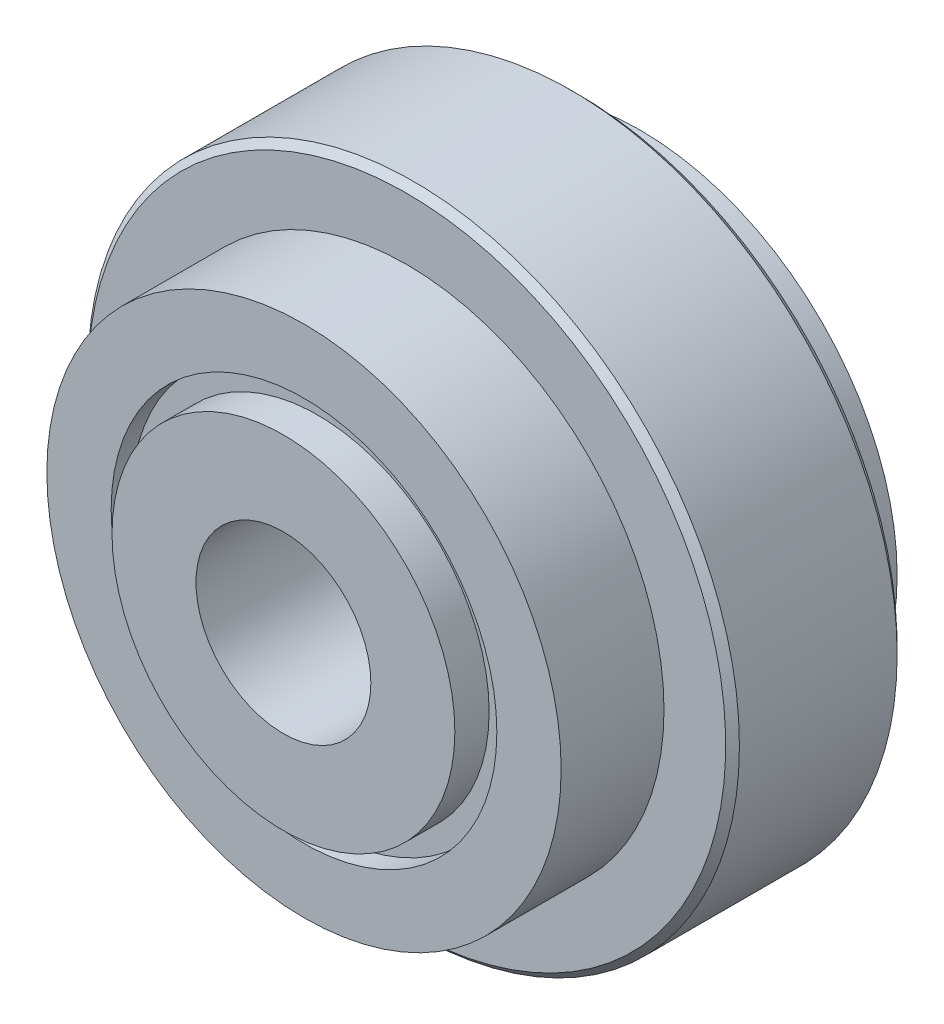
ISO-10303-21;
HEADER;
FILE_DESCRIPTION(('STEP AP214'),'2;1');
FILE_NAME('part.step','',(''),(''),'','','');
FILE_SCHEMA(('AUTOMOTIVE_DESIGN { 1 0 10303 214 1 1 1 1 }'));
ENDSEC;
DATA;
#1=APPLICATION_CONTEXT('core data for automotive mechanical design processes');
#2=APPLICATION_PROTOCOL_DEFINITION('international standard','automotive_design',2000,#1);
#3=PRODUCT_CONTEXT('',#1,'mechanical');
#4=PRODUCT('Part','Part','',(#3));
#5=PRODUCT_RELATED_PRODUCT_CATEGORY('part','',(#4));
#6=PRODUCT_DEFINITION_FORMATION('','',#4);
#7=PRODUCT_DEFINITION_CONTEXT('part definition',#1,'design');
#8=PRODUCT_DEFINITION('design','',#6,#7);
#9=PRODUCT_DEFINITION_SHAPE('','',#8);
#10=(LENGTH_UNIT() NAMED_UNIT(*) SI_UNIT(.MILLI.,.METRE.));
#11=(NAMED_UNIT(*) PLANE_ANGLE_UNIT() SI_UNIT($,.RADIAN.));
#12=(NAMED_UNIT(*) SI_UNIT($,.STERADIAN.) SOLID_ANGLE_UNIT());
#13=UNCERTAINTY_MEASURE_WITH_UNIT(LENGTH_MEASURE(1.E-05),#10,'distance_accuracy_value','');
#14=(GEOMETRIC_REPRESENTATION_CONTEXT(3) GLOBAL_UNCERTAINTY_ASSIGNED_CONTEXT((#13)) GLOBAL_UNIT_ASSIGNED_CONTEXT((#10,
#11,#12)) REPRESENTATION_CONTEXT('',''));
#15=CARTESIAN_POINT('',(0.,0.,0.));
#16=DIRECTION('',(0.,0.,1.));
#17=DIRECTION('',(1.,0.,0.));
#18=AXIS2_PLACEMENT_3D('',#15,#16,#17);
#19=CARTESIAN_POINT('',(0.,-5.,-4.5));
#20=DIRECTION('',(0.,0.,-1.));
#21=DIRECTION('',(-1.,0.,0.));
#22=AXIS2_PLACEMENT_3D('',#19,#20,#21);
#23=PLANE('',#22);
#24=CARTESIAN_POINT('',(0.,0.,-4.5));
#25=DIRECTION('',(0.,0.,1.));
#26=DIRECTION('',(1.,0.,0.));
#27=AXIS2_PLACEMENT_3D('',#24,#25,#26);
#28=CIRCLE('',#27,2.75);
#29=CARTESIAN_POINT('',(2.75,0.,-4.5));
#30=VERTEX_POINT('',#29);
#31=EDGE_CURVE('E11',#30,#30,#28,.T.);
#32=ORIENTED_EDGE('',*,*,#31,.F.);
#33=EDGE_LOOP('',(#32));
#34=FACE_BOUND('',#33,.T.);
#35=CARTESIAN_POINT('',(0.,0.,-4.5));
#36=DIRECTION('',(0.,0.,1.));
#37=DIRECTION('',(1.,0.,0.));
#38=AXIS2_PLACEMENT_3D('',#35,#36,#37);
#39=CIRCLE('',#38,5.);
#40=CARTESIAN_POINT('',(5.,0.,-4.5));
#41=VERTEX_POINT('',#40);
#42=EDGE_CURVE('E57',#41,#41,#39,.T.);
#43=ORIENTED_EDGE('',*,*,#42,.T.);
#44=EDGE_LOOP('',(#43));
#45=FACE_BOUND('',#44,.T.);
#46=ADVANCED_FACE('F43',(#34,#45),#23,.F.);
#47=CARTESIAN_POINT('',(0.,0.,4.9));
#48=DIRECTION('',(0.,0.,1.));
#49=DIRECTION('',(1.,0.,0.));
#50=AXIS2_PLACEMENT_3D('',#47,#48,#49);
#51=CYLINDRICAL_SURFACE('',#50,2.75);
#52=CARTESIAN_POINT('',(0.,0.,-5.5));
#53=DIRECTION('',(0.,0.,1.));
#54=DIRECTION('',(1.,0.,0.));
#55=AXIS2_PLACEMENT_3D('',#52,#53,#54);
#56=CIRCLE('',#55,2.75);
#57=CARTESIAN_POINT('',(2.75,0.,-5.5));
#58=VERTEX_POINT('',#57);
#59=EDGE_CURVE('E49',#58,#58,#56,.T.);
#60=ORIENTED_EDGE('',*,*,#59,.F.);
#61=EDGE_LOOP('',(#60));
#62=FACE_BOUND('',#61,.T.);
#63=ORIENTED_EDGE('',*,*,#31,.T.);
#64=EDGE_LOOP('',(#63));
#65=FACE_BOUND('',#64,.T.);
#66=ADVANCED_FACE('F72',(#62,#65),#51,.F.);
#67=CARTESIAN_POINT('',(0.,-5.,-5.5));
#68=DIRECTION('',(0.,0.,1.));
#69=DIRECTION('',(1.,0.,0.));
#70=AXIS2_PLACEMENT_3D('',#67,#68,#69);
#71=PLANE('',#70);
#72=CARTESIAN_POINT('',(0.,0.,-5.5));
#73=DIRECTION('',(0.,0.,1.));
#74=DIRECTION('',(1.,0.,0.));
#75=AXIS2_PLACEMENT_3D('',#72,#73,#74);
#76=CIRCLE('',#75,5.);
#77=CARTESIAN_POINT('',(5.,0.,-5.5));
#78=VERTEX_POINT('',#77);
#79=EDGE_CURVE('E53',#78,#78,#76,.T.);
#80=ORIENTED_EDGE('',*,*,#79,.F.);
#81=EDGE_LOOP('',(#80));
#82=FACE_BOUND('',#81,.T.);
#83=ORIENTED_EDGE('',*,*,#59,.T.);
#84=EDGE_LOOP('',(#83));
#85=FACE_BOUND('',#84,.T.);
#86=ADVANCED_FACE('F67',(#82,#85),#71,.F.);
#87=CARTESIAN_POINT('',(0.,0.,4.9));
#88=DIRECTION('',(0.,0.,1.));
#89=DIRECTION('',(1.,0.,0.));
#90=AXIS2_PLACEMENT_3D('',#87,#88,#89);
#91=CYLINDRICAL_SURFACE('',#90,5.);
#92=ORIENTED_EDGE('',*,*,#42,.F.);
#93=EDGE_LOOP('',(#92));
#94=FACE_BOUND('',#93,.T.);
#95=ORIENTED_EDGE('',*,*,#79,.T.);
#96=EDGE_LOOP('',(#95));
#97=FACE_BOUND('',#96,.T.);
#98=ADVANCED_FACE('F64',(#94,#97),#91,.T.);
#99=CLOSED_SHELL('',(#46,#66,#86,#98));
#100=MANIFOLD_SOLID_BREP('B2',#99);
#101=CARTESIAN_POINT('',(0.,5.,5.5));
#102=DIRECTION('',(0.,0.,-1.));
#103=DIRECTION('',(-1.,0.,0.));
#104=AXIS2_PLACEMENT_3D('',#101,#102,#103);
#105=PLANE('',#104);
#106=CARTESIAN_POINT('',(0.,0.,5.5));
#107=DIRECTION('',(0.,0.,1.));
#108=DIRECTION('',(1.,0.,0.));
#109=AXIS2_PLACEMENT_3D('',#106,#107,#108);
#110=CIRCLE('',#109,2.55);
#111=CARTESIAN_POINT('',(2.55,0.,5.5));
#112=VERTEX_POINT('',#111);
#113=EDGE_CURVE('E42',#112,#112,#110,.T.);
#114=ORIENTED_EDGE('',*,*,#113,.F.);
#115=EDGE_LOOP('',(#114));
#116=FACE_BOUND('',#115,.T.);
#117=CARTESIAN_POINT('',(0.,0.,5.5));
#118=DIRECTION('',(0.,0.,1.));
#119=DIRECTION('',(1.,0.,0.));
#120=AXIS2_PLACEMENT_3D('',#117,#118,#119);
#121=CIRCLE('',#120,5.);
#122=CARTESIAN_POINT('',(5.,0.,5.5));
#123=VERTEX_POINT('',#122);
#124=EDGE_CURVE('E133',#123,#123,#121,.T.);
#125=ORIENTED_EDGE('',*,*,#124,.T.);
#126=EDGE_LOOP('',(#125));
#127=FACE_BOUND('',#126,.T.);
#128=ADVANCED_FACE('F111',(#116,#127),#105,.F.);
#129=CARTESIAN_POINT('',(0.,0.,4.9));
#130=DIRECTION('',(0.,0.,1.));
#131=DIRECTION('',(1.,0.,0.));
#132=AXIS2_PLACEMENT_3D('',#129,#130,#131);
#133=CYLINDRICAL_SURFACE('',#132,2.55);
#134=CARTESIAN_POINT('',(0.,0.,-4.5));
#135=DIRECTION('',(0.,0.,1.));
#136=DIRECTION('',(1.,0.,0.));
#137=AXIS2_PLACEMENT_3D('',#134,#135,#136);
#138=CIRCLE('',#137,2.55);
#139=CARTESIAN_POINT('',(2.55,0.,-4.5));
#140=VERTEX_POINT('',#139);
#141=EDGE_CURVE('E117',#140,#140,#138,.T.);
#142=ORIENTED_EDGE('',*,*,#141,.F.);
#143=EDGE_LOOP('',(#142));
#144=FACE_BOUND('',#143,.T.);
#145=ORIENTED_EDGE('',*,*,#113,.T.);
#146=EDGE_LOOP('',(#145));
#147=FACE_BOUND('',#146,.T.);
#148=ADVANCED_FACE('F158',(#144,#147),#133,.F.);
#149=CARTESIAN_POINT('',(0.,3.5,-4.5));
#150=DIRECTION('',(0.,0.,1.));
#151=DIRECTION('',(1.,0.,0.));
#152=AXIS2_PLACEMENT_3D('',#149,#150,#151);
#153=PLANE('',#152);
#154=CARTESIAN_POINT('',(0.,0.,-4.5));
#155=DIRECTION('',(0.,0.,1.));
#156=DIRECTION('',(1.,0.,0.));
#157=AXIS2_PLACEMENT_3D('',#154,#155,#156);
#158=CIRCLE('',#157,3.5);
#159=CARTESIAN_POINT('',(3.5,0.,-4.5));
#160=VERTEX_POINT('',#159);
#161=EDGE_CURVE('E121',#160,#160,#158,.T.);
#162=ORIENTED_EDGE('',*,*,#161,.F.);
#163=EDGE_LOOP('',(#162));
#164=FACE_BOUND('',#163,.T.);
#165=ORIENTED_EDGE('',*,*,#141,.T.);
#166=EDGE_LOOP('',(#165));
#167=FACE_BOUND('',#166,.T.);
#168=ADVANCED_FACE('F153',(#164,#167),#153,.F.);
#169=CARTESIAN_POINT('',(0.,0.,4.9));
#170=DIRECTION('',(0.,0.,1.));
#171=DIRECTION('',(1.,0.,0.));
#172=AXIS2_PLACEMENT_3D('',#169,#170,#171);
#173=CYLINDRICAL_SURFACE('',#172,3.5);
#174=CARTESIAN_POINT('',(0.,0.,4.5));
#175=DIRECTION('',(0.,0.,1.));
#176=DIRECTION('',(1.,0.,0.));
#177=AXIS2_PLACEMENT_3D('',#174,#175,#176);
#178=CIRCLE('',#177,3.5);
#179=CARTESIAN_POINT('',(3.5,0.,4.5));
#180=VERTEX_POINT('',#179);
#181=EDGE_CURVE('E125',#180,#180,#178,.T.);
#182=ORIENTED_EDGE('',*,*,#181,.F.);
#183=EDGE_LOOP('',(#182));
#184=FACE_BOUND('',#183,.T.);
#185=ORIENTED_EDGE('',*,*,#161,.T.);
#186=EDGE_LOOP('',(#185));
#187=FACE_BOUND('',#186,.T.);
#188=ADVANCED_FACE('F147',(#184,#187),#173,.T.);
#189=CARTESIAN_POINT('',(0.,5.,4.5));
#190=DIRECTION('',(0.,0.,1.));
#191=DIRECTION('',(1.,0.,0.));
#192=AXIS2_PLACEMENT_3D('',#189,#190,#191);
#193=PLANE('',#192);
#194=CARTESIAN_POINT('',(0.,0.,4.5));
#195=DIRECTION('',(0.,0.,1.));
#196=DIRECTION('',(1.,0.,0.));
#197=AXIS2_PLACEMENT_3D('',#194,#195,#196);
#198=CIRCLE('',#197,5.);
#199=CARTESIAN_POINT('',(5.,0.,4.5));
#200=VERTEX_POINT('',#199);
#201=EDGE_CURVE('E130',#200,#200,#198,.T.);
#202=ORIENTED_EDGE('',*,*,#201,.F.);
#203=EDGE_LOOP('',(#202));
#204=FACE_BOUND('',#203,.T.);
#205=ORIENTED_EDGE('',*,*,#181,.T.);
#206=EDGE_LOOP('',(#205));
#207=FACE_BOUND('',#206,.T.);
#208=ADVANCED_FACE('F141',(#204,#207),#193,.F.);
#209=CARTESIAN_POINT('',(0.,0.,4.9));
#210=DIRECTION('',(0.,0.,1.));
#211=DIRECTION('',(1.,0.,0.));
#212=AXIS2_PLACEMENT_3D('',#209,#210,#211);
#213=CYLINDRICAL_SURFACE('',#212,5.);
#214=ORIENTED_EDGE('',*,*,#124,.F.);
#215=EDGE_LOOP('',(#214));
#216=FACE_BOUND('',#215,.T.);
#217=ORIENTED_EDGE('',*,*,#201,.T.);
#218=EDGE_LOOP('',(#217));
#219=FACE_BOUND('',#218,.T.);
#220=ADVANCED_FACE('F138',(#216,#219),#213,.T.);
#221=CLOSED_SHELL('',(#128,#148,#168,#188,#208,#220));
#222=MANIFOLD_SOLID_BREP('B6',#221);
#223=CARTESIAN_POINT('',(0.,0.,-4.9));
#224=DIRECTION('',(0.,0.,-1.));
#225=DIRECTION('',(-1.,0.,0.));
#226=AXIS2_PLACEMENT_3D('',#223,#224,#225);
#227=CYLINDRICAL_SURFACE('',#226,9.5);
#228=CARTESIAN_POINT('',(0.,0.,1.7));
#229=DIRECTION('',(0.,0.,-1.));
#230=DIRECTION('',(-1.,0.,0.));
#231=AXIS2_PLACEMENT_3D('',#228,#229,#230);
#232=CIRCLE('',#231,9.5);
#233=CARTESIAN_POINT('',(-9.5,0.,1.7));
#234=VERTEX_POINT('',#233);
#235=EDGE_CURVE('E254',#234,#234,#232,.T.);
#236=ORIENTED_EDGE('',*,*,#235,.T.);
#237=EDGE_LOOP('',(#236));
#238=FACE_BOUND('',#237,.T.);
#239=CARTESIAN_POINT('',(0.,0.,-2.9));
#240=DIRECTION('',(0.,0.,-1.));
#241=DIRECTION('',(-1.,0.,0.));
#242=AXIS2_PLACEMENT_3D('',#239,#240,#241);
#243=CIRCLE('',#242,9.5);
#244=CARTESIAN_POINT('',(-9.5,0.,-2.9));
#245=VERTEX_POINT('',#244);
#246=EDGE_CURVE('E110',#245,#245,#243,.T.);
#247=ORIENTED_EDGE('',*,*,#246,.F.);
#248=EDGE_LOOP('',(#247));
#249=FACE_BOUND('',#248,.T.);
#250=ADVANCED_FACE('F202',(#238,#249),#227,.T.);
#251=CARTESIAN_POINT('',(0.,0.,-3.1));
#252=DIRECTION('',(0.,0.,1.));
#253=DIRECTION('',(1.,0.,0.));
#254=AXIS2_PLACEMENT_3D('',#251,#252,#253);
#255=CONICAL_SURFACE('',#254,9.3,0.785398163397441);
#256=ORIENTED_EDGE('',*,*,#246,.T.);
#257=EDGE_LOOP('',(#256));
#258=FACE_BOUND('',#257,.T.);
#259=CARTESIAN_POINT('',(0.,0.,-3.1));
#260=DIRECTION('',(0.,0.,-1.));
#261=DIRECTION('',(-1.,0.,0.));
#262=AXIS2_PLACEMENT_3D('',#259,#260,#261);
#263=CIRCLE('',#262,9.3);
#264=CARTESIAN_POINT('',(-9.3,0.,-3.1));
#265=VERTEX_POINT('',#264);
#266=EDGE_CURVE('E208',#265,#265,#263,.T.);
#267=ORIENTED_EDGE('',*,*,#266,.F.);
#268=EDGE_LOOP('',(#267));
#269=FACE_BOUND('',#268,.T.);
#270=ADVANCED_FACE('F272',(#258,#269),#255,.T.);
#271=CARTESIAN_POINT('',(0.,-9.3,-3.1));
#272=DIRECTION('',(0.,0.,-1.));
#273=DIRECTION('',(-1.,0.,0.));
#274=AXIS2_PLACEMENT_3D('',#271,#272,#273);
#275=PLANE('',#274);
#276=ORIENTED_EDGE('',*,*,#266,.T.);
#277=EDGE_LOOP('',(#276));
#278=FACE_BOUND('',#277,.T.);
#279=CARTESIAN_POINT('',(0.,0.,-3.1));
#280=DIRECTION('',(0.,0.,-1.));
#281=DIRECTION('',(-1.,0.,0.));
#282=AXIS2_PLACEMENT_3D('',#279,#280,#281);
#283=CIRCLE('',#282,7.5);
#284=CARTESIAN_POINT('',(-7.5,0.,-3.1));
#285=VERTEX_POINT('',#284);
#286=EDGE_CURVE('E212',#285,#285,#283,.T.);
#287=ORIENTED_EDGE('',*,*,#286,.F.);
#288=EDGE_LOOP('',(#287));
#289=FACE_BOUND('',#288,.T.);
#290=ADVANCED_FACE('F276',(#278,#289),#275,.T.);
#291=CARTESIAN_POINT('',(0.,0.,-4.9));
#292=DIRECTION('',(0.,0.,-1.));
#293=DIRECTION('',(-1.,0.,0.));
#294=AXIS2_PLACEMENT_3D('',#291,#292,#293);
#295=CYLINDRICAL_SURFACE('',#294,7.5);
#296=ORIENTED_EDGE('',*,*,#286,.T.);
#297=EDGE_LOOP('',(#296));
#298=FACE_BOUND('',#297,.T.);
#299=CARTESIAN_POINT('',(0.,0.,-4.9));
#300=DIRECTION('',(0.,0.,-1.));
#301=DIRECTION('',(-1.,0.,0.));
#302=AXIS2_PLACEMENT_3D('',#299,#300,#301);
#303=CIRCLE('',#302,7.5);
#304=CARTESIAN_POINT('',(-7.5,0.,-4.9));
#305=VERTEX_POINT('',#304);
#306=EDGE_CURVE('E216',#305,#305,#303,.T.);
#307=ORIENTED_EDGE('',*,*,#306,.F.);
#308=EDGE_LOOP('',(#307));
#309=FACE_BOUND('',#308,.T.);
#310=ADVANCED_FACE('F280',(#298,#309),#295,.T.);
#311=CARTESIAN_POINT('',(0.,-5.625,-4.9));
#312=DIRECTION('',(0.,0.,-1.));
#313=DIRECTION('',(-1.,0.,0.));
#314=AXIS2_PLACEMENT_3D('',#311,#312,#313);
#315=PLANE('',#314);
#316=ORIENTED_EDGE('',*,*,#306,.T.);
#317=EDGE_LOOP('',(#316));
#318=FACE_BOUND('',#317,.T.);
#319=CARTESIAN_POINT('',(0.,0.,-4.9));
#320=DIRECTION('',(0.,0.,-1.));
#321=DIRECTION('',(-1.,0.,0.));
#322=AXIS2_PLACEMENT_3D('',#319,#320,#321);
#323=CIRCLE('',#322,5.625);
#324=CARTESIAN_POINT('',(-5.625,0.,-4.9));
#325=VERTEX_POINT('',#324);
#326=EDGE_CURVE('E221',#325,#325,#323,.T.);
#327=ORIENTED_EDGE('',*,*,#326,.F.);
#328=EDGE_LOOP('',(#327));
#329=FACE_BOUND('',#328,.T.);
#330=ADVANCED_FACE('F286',(#318,#329),#315,.T.);
#331=CARTESIAN_POINT('',(0.,0.,-4.9));
#332=DIRECTION('',(0.,0.,-1.));
#333=DIRECTION('',(-1.,0.,0.));
#334=AXIS2_PLACEMENT_3D('',#331,#332,#333);
#335=CYLINDRICAL_SURFACE('',#334,5.625);
#336=ORIENTED_EDGE('',*,*,#326,.T.);
#337=EDGE_LOOP('',(#336));
#338=FACE_BOUND('',#337,.T.);
#339=CARTESIAN_POINT('',(0.,0.,-4.3));
#340=DIRECTION('',(0.,0.,-1.));
#341=DIRECTION('',(-1.,0.,0.));
#342=AXIS2_PLACEMENT_3D('',#339,#340,#341);
#343=CIRCLE('',#342,5.625);
#344=CARTESIAN_POINT('',(-5.625,0.,-4.3));
#345=VERTEX_POINT('',#344);
#346=EDGE_CURVE('E224',#345,#345,#343,.T.);
#347=ORIENTED_EDGE('',*,*,#346,.F.);
#348=EDGE_LOOP('',(#347));
#349=FACE_BOUND('',#348,.T.);
#350=ADVANCED_FACE('F290',(#338,#349),#335,.F.);
#351=CARTESIAN_POINT('',(0.,-4.05,-4.3));
#352=DIRECTION('',(0.,0.,-1.));
#353=DIRECTION('',(-1.,0.,0.));
#354=AXIS2_PLACEMENT_3D('',#351,#352,#353);
#355=PLANE('',#354);
#356=ORIENTED_EDGE('',*,*,#346,.T.);
#357=EDGE_LOOP('',(#356));
#358=FACE_BOUND('',#357,.T.);
#359=CARTESIAN_POINT('',(0.,0.,-4.3));
#360=DIRECTION('',(0.,0.,-1.));
#361=DIRECTION('',(-1.,0.,0.));
#362=AXIS2_PLACEMENT_3D('',#359,#360,#361);
#363=CIRCLE('',#362,4.05);
#364=CARTESIAN_POINT('',(-4.05,0.,-4.3));
#365=VERTEX_POINT('',#364);
#366=EDGE_CURVE('E227',#365,#365,#363,.T.);
#367=ORIENTED_EDGE('',*,*,#366,.F.);
#368=EDGE_LOOP('',(#367));
#369=FACE_BOUND('',#368,.T.);
#370=ADVANCED_FACE('F294',(#358,#369),#355,.T.);
#371=CARTESIAN_POINT('',(0.,0.,-3.8));
#372=DIRECTION('',(0.,0.,-1.));
#373=DIRECTION('',(-1.,0.,0.));
#374=AXIS2_PLACEMENT_3D('',#371,#372,#373);
#375=TOROIDAL_SURFACE('',#374,4.05,0.5);
#376=ORIENTED_EDGE('',*,*,#366,.T.);
#377=EDGE_LOOP('',(#376));
#378=FACE_BOUND('',#377,.T.);
#379=CARTESIAN_POINT('',(0.,0.,-3.8));
#380=DIRECTION('',(0.,0.,-1.));
#381=DIRECTION('',(-1.,0.,0.));
#382=AXIS2_PLACEMENT_3D('',#379,#380,#381);
#383=CIRCLE('',#382,3.55);
#384=CARTESIAN_POINT('',(-3.55,0.,-3.8));
#385=VERTEX_POINT('',#384);
#386=EDGE_CURVE('E230',#385,#385,#383,.T.);
#387=ORIENTED_EDGE('',*,*,#386,.F.);
#388=EDGE_LOOP('',(#387));
#389=FACE_BOUND('',#388,.T.);
#390=ADVANCED_FACE('F298',(#378,#389),#375,.T.);
#391=CARTESIAN_POINT('',(0.,0.,-4.9));
#392=DIRECTION('',(0.,0.,-1.));
#393=DIRECTION('',(-1.,0.,0.));
#394=AXIS2_PLACEMENT_3D('',#391,#392,#393);
#395=CYLINDRICAL_SURFACE('',#394,3.55);
#396=ORIENTED_EDGE('',*,*,#386,.T.);
#397=EDGE_LOOP('',(#396));
#398=FACE_BOUND('',#397,.T.);
#399=CARTESIAN_POINT('',(0.,0.,3.8));
#400=DIRECTION('',(0.,0.,-1.));
#401=DIRECTION('',(-1.,0.,0.));
#402=AXIS2_PLACEMENT_3D('',#399,#400,#401);
#403=CIRCLE('',#402,3.55);
#404=CARTESIAN_POINT('',(-3.55,0.,3.8));
#405=VERTEX_POINT('',#404);
#406=EDGE_CURVE('E233',#405,#405,#403,.T.);
#407=ORIENTED_EDGE('',*,*,#406,.F.);
#408=EDGE_LOOP('',(#407));
#409=FACE_BOUND('',#408,.T.);
#410=ADVANCED_FACE('F302',(#398,#409),#395,.F.);
#411=CARTESIAN_POINT('',(0.,0.,3.8));
#412=DIRECTION('',(0.,0.,-1.));
#413=DIRECTION('',(-1.,0.,0.));
#414=AXIS2_PLACEMENT_3D('',#411,#412,#413);
#415=TOROIDAL_SURFACE('',#414,4.05,0.5);
#416=ORIENTED_EDGE('',*,*,#406,.T.);
#417=EDGE_LOOP('',(#416));
#418=FACE_BOUND('',#417,.T.);
#419=CARTESIAN_POINT('',(0.,0.,4.3));
#420=DIRECTION('',(0.,0.,-1.));
#421=DIRECTION('',(-1.,0.,0.));
#422=AXIS2_PLACEMENT_3D('',#419,#420,#421);
#423=CIRCLE('',#422,4.05);
#424=CARTESIAN_POINT('',(-4.05,0.,4.3));
#425=VERTEX_POINT('',#424);
#426=EDGE_CURVE('E236',#425,#425,#423,.T.);
#427=ORIENTED_EDGE('',*,*,#426,.F.);
#428=EDGE_LOOP('',(#427));
#429=FACE_BOUND('',#428,.T.);
#430=ADVANCED_FACE('F306',(#418,#429),#415,.T.);
#431=CARTESIAN_POINT('',(0.,-5.625,4.3));
#432=DIRECTION('',(0.,0.,1.));
#433=DIRECTION('',(1.,0.,0.));
#434=AXIS2_PLACEMENT_3D('',#431,#432,#433);
#435=PLANE('',#434);
#436=ORIENTED_EDGE('',*,*,#426,.T.);
#437=EDGE_LOOP('',(#436));
#438=FACE_BOUND('',#437,.T.);
#439=CARTESIAN_POINT('',(0.,0.,4.3));
#440=DIRECTION('',(0.,0.,-1.));
#441=DIRECTION('',(-1.,0.,0.));
#442=AXIS2_PLACEMENT_3D('',#439,#440,#441);
#443=CIRCLE('',#442,5.625);
#444=CARTESIAN_POINT('',(-5.625,0.,4.3));
#445=VERTEX_POINT('',#444);
#446=EDGE_CURVE('E239',#445,#445,#443,.T.);
#447=ORIENTED_EDGE('',*,*,#446,.F.);
#448=EDGE_LOOP('',(#447));
#449=FACE_BOUND('',#448,.T.);
#450=ADVANCED_FACE('F310',(#438,#449),#435,.T.);
#451=CARTESIAN_POINT('',(0.,0.,-4.9));
#452=DIRECTION('',(0.,0.,-1.));
#453=DIRECTION('',(-1.,0.,0.));
#454=AXIS2_PLACEMENT_3D('',#451,#452,#453);
#455=CYLINDRICAL_SURFACE('',#454,5.625);
#456=ORIENTED_EDGE('',*,*,#446,.T.);
#457=EDGE_LOOP('',(#456));
#458=FACE_BOUND('',#457,.T.);
#459=CARTESIAN_POINT('',(0.,0.,4.9));
#460=DIRECTION('',(0.,0.,-1.));
#461=DIRECTION('',(-1.,0.,0.));
#462=AXIS2_PLACEMENT_3D('',#459,#460,#461);
#463=CIRCLE('',#462,5.625);
#464=CARTESIAN_POINT('',(-5.625,0.,4.9));
#465=VERTEX_POINT('',#464);
#466=EDGE_CURVE('E242',#465,#465,#463,.T.);
#467=ORIENTED_EDGE('',*,*,#466,.F.);
#468=EDGE_LOOP('',(#467));
#469=FACE_BOUND('',#468,.T.);
#470=ADVANCED_FACE('F314',(#458,#469),#455,.F.);
#471=CARTESIAN_POINT('',(0.,-5.625,4.9));
#472=DIRECTION('',(0.,0.,1.));
#473=DIRECTION('',(1.,0.,0.));
#474=AXIS2_PLACEMENT_3D('',#471,#472,#473);
#475=PLANE('',#474);
#476=ORIENTED_EDGE('',*,*,#466,.T.);
#477=EDGE_LOOP('',(#476));
#478=FACE_BOUND('',#477,.T.);
#479=CARTESIAN_POINT('',(0.,0.,4.9));
#480=DIRECTION('',(0.,0.,-1.));
#481=DIRECTION('',(-1.,0.,0.));
#482=AXIS2_PLACEMENT_3D('',#479,#480,#481);
#483=CIRCLE('',#482,7.5);
#484=CARTESIAN_POINT('',(-7.5,0.,4.9));
#485=VERTEX_POINT('',#484);
#486=EDGE_CURVE('E245',#485,#485,#483,.T.);
#487=ORIENTED_EDGE('',*,*,#486,.F.);
#488=EDGE_LOOP('',(#487));
#489=FACE_BOUND('',#488,.T.);
#490=ADVANCED_FACE('F318',(#478,#489),#475,.T.);
#491=CARTESIAN_POINT('',(0.,0.,-4.9));
#492=DIRECTION('',(0.,0.,-1.));
#493=DIRECTION('',(-1.,0.,0.));
#494=AXIS2_PLACEMENT_3D('',#491,#492,#493);
#495=CYLINDRICAL_SURFACE('',#494,7.5);
#496=ORIENTED_EDGE('',*,*,#486,.T.);
#497=EDGE_LOOP('',(#496));
#498=FACE_BOUND('',#497,.T.);
#499=CARTESIAN_POINT('',(0.,0.,1.9));
#500=DIRECTION('',(0.,0.,-1.));
#501=DIRECTION('',(-1.,0.,0.));
#502=AXIS2_PLACEMENT_3D('',#499,#500,#501);
#503=CIRCLE('',#502,7.5);
#504=CARTESIAN_POINT('',(-7.5,0.,1.9));
#505=VERTEX_POINT('',#504);
#506=EDGE_CURVE('E248',#505,#505,#503,.T.);
#507=ORIENTED_EDGE('',*,*,#506,.F.);
#508=EDGE_LOOP('',(#507));
#509=FACE_BOUND('',#508,.T.);
#510=ADVANCED_FACE('F268',(#498,#509),#495,.T.);
#511=CARTESIAN_POINT('',(0.,-7.5,1.9));
#512=DIRECTION('',(0.,0.,1.));
#513=DIRECTION('',(1.,0.,0.));
#514=AXIS2_PLACEMENT_3D('',#511,#512,#513);
#515=PLANE('',#514);
#516=ORIENTED_EDGE('',*,*,#506,.T.);
#517=EDGE_LOOP('',(#516));
#518=FACE_BOUND('',#517,.T.);
#519=CARTESIAN_POINT('',(0.,0.,1.9));
#520=DIRECTION('',(0.,0.,-1.));
#521=DIRECTION('',(-1.,0.,0.));
#522=AXIS2_PLACEMENT_3D('',#519,#520,#521);
#523=CIRCLE('',#522,9.3);
#524=CARTESIAN_POINT('',(-9.3,0.,1.9));
#525=VERTEX_POINT('',#524);
#526=EDGE_CURVE('E251',#525,#525,#523,.T.);
#527=ORIENTED_EDGE('',*,*,#526,.F.);
#528=EDGE_LOOP('',(#527));
#529=FACE_BOUND('',#528,.T.);
#530=ADVANCED_FACE('F262',(#518,#529),#515,.T.);
#531=CARTESIAN_POINT('',(0.,0.,1.7));
#532=DIRECTION('',(0.,0.,-1.));
#533=DIRECTION('',(-1.,0.,0.));
#534=AXIS2_PLACEMENT_3D('',#531,#532,#533);
#535=CONICAL_SURFACE('',#534,9.5,0.785398163397442);
#536=ORIENTED_EDGE('',*,*,#526,.T.);
#537=EDGE_LOOP('',(#536));
#538=FACE_BOUND('',#537,.T.);
#539=ORIENTED_EDGE('',*,*,#235,.F.);
#540=EDGE_LOOP('',(#539));
#541=FACE_BOUND('',#540,.T.);
#542=ADVANCED_FACE('F260',(#538,#541),#535,.T.);
#543=CLOSED_SHELL('',(#250,#270,#290,#310,#330,#350,#370,#390,#410,#430,#450,#470,#490,#510,
#530,#542));
#544=MANIFOLD_SOLID_BREP('B37',#543);
#545=ADVANCED_BREP_SHAPE_REPRESENTATION('',(#18,#100,#222,#544),#14);
#546=SHAPE_DEFINITION_REPRESENTATION(#9,#545);
ENDSEC;
END-ISO-10303-21;
